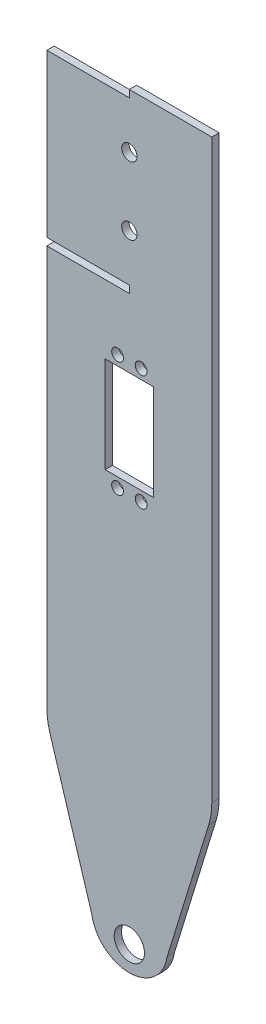
ISO-10303-21;
HEADER;
FILE_DESCRIPTION(('STEP AP214'),'2;1');
FILE_NAME('part.step','',(''),(''),'','','');
FILE_SCHEMA(('AUTOMOTIVE_DESIGN { 1 0 10303 214 1 1 1 1 }'));
ENDSEC;
DATA;
#1=APPLICATION_CONTEXT('core data for automotive mechanical design processes');
#2=APPLICATION_PROTOCOL_DEFINITION('international standard','automotive_design',2000,#1);
#3=PRODUCT_CONTEXT('',#1,'mechanical');
#4=PRODUCT('Part','Part','',(#3));
#5=PRODUCT_RELATED_PRODUCT_CATEGORY('part','',(#4));
#6=PRODUCT_DEFINITION_FORMATION('','',#4);
#7=PRODUCT_DEFINITION_CONTEXT('part definition',#1,'design');
#8=PRODUCT_DEFINITION('design','',#6,#7);
#9=PRODUCT_DEFINITION_SHAPE('','',#8);
#10=(LENGTH_UNIT() NAMED_UNIT(*) SI_UNIT(.MILLI.,.METRE.));
#11=(NAMED_UNIT(*) PLANE_ANGLE_UNIT() SI_UNIT($,.RADIAN.));
#12=(NAMED_UNIT(*) SI_UNIT($,.STERADIAN.) SOLID_ANGLE_UNIT());
#13=UNCERTAINTY_MEASURE_WITH_UNIT(LENGTH_MEASURE(1.E-05),#10,'distance_accuracy_value','');
#14=(GEOMETRIC_REPRESENTATION_CONTEXT(3) GLOBAL_UNCERTAINTY_ASSIGNED_CONTEXT((#13)) GLOBAL_UNIT_ASSIGNED_CONTEXT((#10,
#11,#12)) REPRESENTATION_CONTEXT('',''));
#15=CARTESIAN_POINT('',(0.,0.,0.));
#16=DIRECTION('',(0.,0.,1.));
#17=DIRECTION('',(1.,0.,0.));
#18=AXIS2_PLACEMENT_3D('',#15,#16,#17);
#19=CARTESIAN_POINT('',(-35.,-174.575,3.1));
#20=DIRECTION('',(1.,0.,0.));
#21=DIRECTION('',(0.,1.,0.));
#22=AXIS2_PLACEMENT_3D('',#19,#20,#21);
#23=PLANE('',#22);
#24=DIRECTION('',(0.,-1.,0.));
#25=VECTOR('',#24,1.);
#26=CARTESIAN_POINT('',(-35.,-174.575,3.1));
#27=LINE('',#26,#25);
#28=CARTESIAN_POINT('',(-35.,99.5750000000002,3.1));
#29=VERTEX_POINT('',#28);
#30=CARTESIAN_POINT('',(-35.,-70.0601124496381,3.1));
#31=VERTEX_POINT('',#30);
#32=EDGE_CURVE('E297',#29,#31,#27,.T.);
#33=ORIENTED_EDGE('',*,*,#32,.F.);
#34=DIRECTION('',(0.,0.,1.));
#35=VECTOR('',#34,1.);
#36=CARTESIAN_POINT('',(-35.,99.5750000000002,0.));
#37=LINE('',#36,#35);
#38=CARTESIAN_POINT('',(-35.,99.5750000000002,0.));
#39=VERTEX_POINT('',#38);
#40=EDGE_CURVE('E192',#39,#29,#37,.T.);
#41=ORIENTED_EDGE('',*,*,#40,.F.);
#42=DIRECTION('',(0.,-1.,0.));
#43=VECTOR('',#42,1.);
#44=CARTESIAN_POINT('',(-35.,-174.575,0.));
#45=LINE('',#44,#43);
#46=CARTESIAN_POINT('',(-35.,-70.0601124496381,0.));
#47=VERTEX_POINT('',#46);
#48=EDGE_CURVE('E306',#39,#47,#45,.T.);
#49=ORIENTED_EDGE('',*,*,#48,.T.);
#50=DIRECTION('',(0.,0.,-1.));
#51=VECTOR('',#50,1.);
#52=CARTESIAN_POINT('',(-35.,-70.0601124496381,3.1000000000001));
#53=LINE('',#52,#51);
#54=EDGE_CURVE('E320',#47,#31,#53,.F.);
#55=ORIENTED_EDGE('',*,*,#54,.T.);
#56=EDGE_LOOP('',(#33,#41,#49,#55));
#57=FACE_BOUND('',#56,.T.);
#58=ADVANCED_FACE('F32',(#57),#23,.F.);
#59=CARTESIAN_POINT('',(0.,0.,3.1));
#60=DIRECTION('',(0.,0.,-1.));
#61=DIRECTION('',(-1.,0.,0.));
#62=AXIS2_PLACEMENT_3D('',#59,#60,#61);
#63=PLANE('',#62);
#64=CARTESIAN_POINT('',(0.,151.475,3.1));
#65=DIRECTION('',(0.,0.,1.));
#66=DIRECTION('',(1.,0.,0.));
#67=AXIS2_PLACEMENT_3D('',#64,#65,#66);
#68=CIRCLE('',#67,3.25);
#69=CARTESIAN_POINT('',(3.25,151.475,3.1));
#70=VERTEX_POINT('',#69);
#71=EDGE_CURVE('E469',#70,#70,#68,.T.);
#72=ORIENTED_EDGE('',*,*,#71,.F.);
#73=EDGE_LOOP('',(#72));
#74=FACE_BOUND('',#73,.T.);
#75=CARTESIAN_POINT('',(0.,122.675,3.1));
#76=DIRECTION('',(0.,0.,1.));
#77=DIRECTION('',(1.,0.,0.));
#78=AXIS2_PLACEMENT_3D('',#75,#76,#77);
#79=CIRCLE('',#78,3.25);
#80=CARTESIAN_POINT('',(3.25,122.675,3.1));
#81=VERTEX_POINT('',#80);
#82=EDGE_CURVE('E182',#81,#81,#79,.T.);
#83=ORIENTED_EDGE('',*,*,#82,.F.);
#84=EDGE_LOOP('',(#83));
#85=FACE_BOUND('',#84,.T.);
#86=CARTESIAN_POINT('',(-5.00000000000007,25.5750000000002,3.1));
#87=DIRECTION('',(0.,0.,1.));
#88=DIRECTION('',(-1.,0.,0.));
#89=AXIS2_PLACEMENT_3D('',#86,#87,#88);
#90=CIRCLE('',#89,2.5);
#91=CARTESIAN_POINT('',(-7.50000000000007,25.5750000000002,3.1));
#92=VERTEX_POINT('',#91);
#93=EDGE_CURVE('E230',#92,#92,#90,.T.);
#94=ORIENTED_EDGE('',*,*,#93,.F.);
#95=EDGE_LOOP('',(#94));
#96=FACE_BOUND('',#95,.T.);
#97=CARTESIAN_POINT('',(4.99999999999993,74.5750000000002,3.1));
#98=DIRECTION('',(0.,0.,1.));
#99=DIRECTION('',(-1.,0.,0.));
#100=AXIS2_PLACEMENT_3D('',#97,#98,#99);
#101=CIRCLE('',#100,2.5);
#102=CARTESIAN_POINT('',(2.49999999999993,74.5750000000002,3.1));
#103=VERTEX_POINT('',#102);
#104=EDGE_CURVE('E242',#103,#103,#101,.T.);
#105=ORIENTED_EDGE('',*,*,#104,.F.);
#106=EDGE_LOOP('',(#105));
#107=FACE_BOUND('',#106,.T.);
#108=DIRECTION('',(0.,1.,0.));
#109=VECTOR('',#108,1.);
#110=CARTESIAN_POINT('',(10.25,29.7250000000002,3.1));
#111=LINE('',#110,#109);
#112=CARTESIAN_POINT('',(10.25,29.7250000000002,3.1));
#113=VERTEX_POINT('',#112);
#114=CARTESIAN_POINT('',(10.25,70.4250000000002,3.1));
#115=VERTEX_POINT('',#114);
#116=EDGE_CURVE('E254',#113,#115,#111,.T.);
#117=ORIENTED_EDGE('',*,*,#116,.F.);
#118=DIRECTION('',(1.,0.,0.));
#119=VECTOR('',#118,1.);
#120=CARTESIAN_POINT('',(-10.25,29.7250000000002,3.1));
#121=LINE('',#120,#119);
#122=CARTESIAN_POINT('',(-10.25,29.7250000000002,3.1));
#123=VERTEX_POINT('',#122);
#124=EDGE_CURVE('E262',#123,#113,#121,.T.);
#125=ORIENTED_EDGE('',*,*,#124,.F.);
#126=DIRECTION('',(0.,-1.,0.));
#127=VECTOR('',#126,1.);
#128=CARTESIAN_POINT('',(-10.25,29.7250000000002,3.1));
#129=LINE('',#128,#127);
#130=CARTESIAN_POINT('',(-10.25,70.4250000000002,3.1));
#131=VERTEX_POINT('',#130);
#132=EDGE_CURVE('E259',#131,#123,#129,.T.);
#133=ORIENTED_EDGE('',*,*,#132,.F.);
#134=DIRECTION('',(-1.,0.,0.));
#135=VECTOR('',#134,1.);
#136=CARTESIAN_POINT('',(-10.25,70.4250000000002,3.1));
#137=LINE('',#136,#135);
#138=EDGE_CURVE('E256',#115,#131,#137,.T.);
#139=ORIENTED_EDGE('',*,*,#138,.F.);
#140=EDGE_LOOP('',(#117,#125,#133,#139));
#141=FACE_BOUND('',#140,.T.);
#142=CARTESIAN_POINT('',(0.,-139.575,3.1));
#143=DIRECTION('',(0.,0.,1.));
#144=DIRECTION('',(1.,0.,0.));
#145=AXIS2_PLACEMENT_3D('',#142,#143,#144);
#146=CIRCLE('',#145,6.425);
#147=CARTESIAN_POINT('',(6.42500000000003,-139.575,3.1));
#148=VERTEX_POINT('',#147);
#149=EDGE_CURVE('E285',#148,#148,#146,.T.);
#150=ORIENTED_EDGE('',*,*,#149,.F.);
#151=EDGE_LOOP('',(#150));
#152=FACE_BOUND('',#151,.T.);
#153=CARTESIAN_POINT('',(-5.00000000000007,74.5750000000002,3.1));
#154=DIRECTION('',(0.,0.,1.));
#155=DIRECTION('',(1.,0.,0.));
#156=AXIS2_PLACEMENT_3D('',#153,#154,#155);
#157=CIRCLE('',#156,2.5);
#158=CARTESIAN_POINT('',(-2.50000000000007,74.5750000000002,3.1));
#159=VERTEX_POINT('',#158);
#160=EDGE_CURVE('E248',#159,#159,#157,.T.);
#161=ORIENTED_EDGE('',*,*,#160,.F.);
#162=EDGE_LOOP('',(#161));
#163=FACE_BOUND('',#162,.T.);
#164=CARTESIAN_POINT('',(4.99999999999993,25.5750000000002,3.1));
#165=DIRECTION('',(0.,0.,1.));
#166=DIRECTION('',(1.,0.,0.));
#167=AXIS2_PLACEMENT_3D('',#164,#165,#166);
#168=CIRCLE('',#167,2.5);
#169=CARTESIAN_POINT('',(7.49999999999993,25.5750000000002,3.1));
#170=VERTEX_POINT('',#169);
#171=EDGE_CURVE('E236',#170,#170,#168,.T.);
#172=ORIENTED_EDGE('',*,*,#171,.F.);
#173=EDGE_LOOP('',(#172));
#174=FACE_BOUND('',#173,.T.);
#175=DIRECTION('',(0.,1.,0.));
#176=VECTOR('',#175,1.);
#177=CARTESIAN_POINT('',(0.,102.675,3.1));
#178=LINE('',#177,#176);
#179=CARTESIAN_POINT('',(0.,99.5750000000002,3.1));
#180=VERTEX_POINT('',#179);
#181=CARTESIAN_POINT('',(0.,102.675,3.1));
#182=VERTEX_POINT('',#181);
#183=EDGE_CURVE('E163',#180,#182,#178,.T.);
#184=ORIENTED_EDGE('',*,*,#183,.F.);
#185=DIRECTION('',(1.,0.,0.));
#186=VECTOR('',#185,1.);
#187=CARTESIAN_POINT('',(0.,99.5750000000002,3.1));
#188=LINE('',#187,#186);
#189=EDGE_CURVE('E177',#29,#180,#188,.T.);
#190=ORIENTED_EDGE('',*,*,#189,.F.);
#191=ORIENTED_EDGE('',*,*,#32,.T.);
#192=CARTESIAN_POINT('',(-5.,-70.0601124496381,3.09999999999999));
#193=DIRECTION('',(0.,0.,-1.));
#194=DIRECTION('',(-1.,0.,0.));
#195=AXIS2_PLACEMENT_3D('',#192,#193,#194);
#196=CIRCLE('',#195,30.);
#197=CARTESIAN_POINT('',(-33.6711499797607,-78.8899006032727,3.1));
#198=VERTEX_POINT('',#197);
#199=EDGE_CURVE('E325',#31,#198,#196,.F.);
#200=ORIENTED_EDGE('',*,*,#199,.T.);
#201=DIRECTION('',(-0.294326271787818,0.955704999325359,0.));
#202=VECTOR('',#201,1.);
#203=CARTESIAN_POINT('',(-52.9451554412861,-16.3053978175907,3.1));
#204=LINE('',#203,#202);
#205=CARTESIAN_POINT('',(-16.,-136.269781362475,3.09999999999999));
#206=VERTEX_POINT('',#205);
#207=EDGE_CURVE('E219',#206,#198,#204,.T.);
#208=ORIENTED_EDGE('',*,*,#207,.F.);
#209=CARTESIAN_POINT('',(0.,-133.872837699514,3.09999999999999));
#210=DIRECTION('',(0.,0.,-1.));
#211=DIRECTION('',(-1.,0.,0.));
#212=AXIS2_PLACEMENT_3D('',#209,#210,#211);
#213=CIRCLE('',#212,16.1785456368429);
#214=CARTESIAN_POINT('',(16.,-136.269781362475,3.1));
#215=VERTEX_POINT('',#214);
#216=EDGE_CURVE('E226',#215,#206,#213,.T.);
#217=ORIENTED_EDGE('',*,*,#216,.F.);
#218=DIRECTION('',(-0.294326271787818,-0.955704999325358,0.));
#219=VECTOR('',#218,1.);
#220=CARTESIAN_POINT('',(52.9451554412861,-16.3053978175907,3.1));
#221=LINE('',#220,#219);
#222=CARTESIAN_POINT('',(33.6711499797608,-78.8899006032725,3.1));
#223=VERTEX_POINT('',#222);
#224=EDGE_CURVE('E224',#223,#215,#221,.T.);
#225=ORIENTED_EDGE('',*,*,#224,.F.);
#226=CARTESIAN_POINT('',(5.00000000000005,-70.060112449638,3.09999999999999));
#227=DIRECTION('',(0.,0.,-1.));
#228=DIRECTION('',(-1.,0.,0.));
#229=AXIS2_PLACEMENT_3D('',#226,#227,#228);
#230=CIRCLE('',#229,30.);
#231=CARTESIAN_POINT('',(35.,-70.060112449638,3.1));
#232=VERTEX_POINT('',#231);
#233=EDGE_CURVE('E323',#223,#232,#230,.F.);
#234=ORIENTED_EDGE('',*,*,#233,.T.);
#235=DIRECTION('',(0.,1.,0.));
#236=VECTOR('',#235,1.);
#237=CARTESIAN_POINT('',(35.,-174.575,3.1));
#238=LINE('',#237,#236);
#239=CARTESIAN_POINT('',(35.,174.575,3.1));
#240=VERTEX_POINT('',#239);
#241=EDGE_CURVE('E291',#232,#240,#238,.T.);
#242=ORIENTED_EDGE('',*,*,#241,.T.);
#243=DIRECTION('',(-1.,0.,0.));
#244=VECTOR('',#243,1.);
#245=CARTESIAN_POINT('',(-35.,174.575,3.1));
#246=LINE('',#245,#244);
#247=CARTESIAN_POINT('',(0.,174.575,3.1));
#248=VERTEX_POINT('',#247);
#249=EDGE_CURVE('E293',#240,#248,#246,.T.);
#250=ORIENTED_EDGE('',*,*,#249,.T.);
#251=DIRECTION('',(0.,1.,0.));
#252=VECTOR('',#251,1.);
#253=CARTESIAN_POINT('',(0.,174.575,3.1));
#254=LINE('',#253,#252);
#255=CARTESIAN_POINT('',(0.,171.475,3.1));
#256=VERTEX_POINT('',#255);
#257=EDGE_CURVE('E55',#256,#248,#254,.T.);
#258=ORIENTED_EDGE('',*,*,#257,.F.);
#259=DIRECTION('',(1.,0.,0.));
#260=VECTOR('',#259,1.);
#261=CARTESIAN_POINT('',(-35.,171.475,3.1));
#262=LINE('',#261,#260);
#263=CARTESIAN_POINT('',(-35.,171.475,3.1));
#264=VERTEX_POINT('',#263);
#265=EDGE_CURVE('E191',#264,#256,#262,.T.);
#266=ORIENTED_EDGE('',*,*,#265,.F.);
#267=CARTESIAN_POINT('',(-35.,102.675,3.1));
#268=VERTEX_POINT('',#267);
#269=EDGE_CURVE('E298',#264,#268,#27,.T.);
#270=ORIENTED_EDGE('',*,*,#269,.T.);
#271=DIRECTION('',(-1.,0.,0.));
#272=VECTOR('',#271,1.);
#273=CARTESIAN_POINT('',(0.,102.675,3.1));
#274=LINE('',#273,#272);
#275=EDGE_CURVE('E47',#182,#268,#274,.T.);
#276=ORIENTED_EDGE('',*,*,#275,.F.);
#277=EDGE_LOOP('',(#184,#190,#191,#200,#208,#217,#225,#234,#242,#250,#258,#266,#270,#276));
#278=FACE_BOUND('',#277,.T.);
#279=ADVANCED_FACE('F336',(#74,#85,#96,#107,#141,#152,#163,#174,#278),#63,.F.);
#280=CARTESIAN_POINT('',(0.,0.,0.));
#281=DIRECTION('',(0.,0.,-1.));
#282=DIRECTION('',(-1.,0.,0.));
#283=AXIS2_PLACEMENT_3D('',#280,#281,#282);
#284=PLANE('',#283);
#285=CARTESIAN_POINT('',(0.,151.475,0.));
#286=DIRECTION('',(0.,0.,1.));
#287=DIRECTION('',(1.,0.,0.));
#288=AXIS2_PLACEMENT_3D('',#285,#286,#287);
#289=CIRCLE('',#288,3.25);
#290=CARTESIAN_POINT('',(3.25,151.475,0.));
#291=VERTEX_POINT('',#290);
#292=EDGE_CURVE('E466',#291,#291,#289,.T.);
#293=ORIENTED_EDGE('',*,*,#292,.T.);
#294=EDGE_LOOP('',(#293));
#295=FACE_BOUND('',#294,.T.);
#296=CARTESIAN_POINT('',(0.,122.675,0.));
#297=DIRECTION('',(0.,0.,1.));
#298=DIRECTION('',(1.,0.,0.));
#299=AXIS2_PLACEMENT_3D('',#296,#297,#298);
#300=CIRCLE('',#299,3.25);
#301=CARTESIAN_POINT('',(3.25,122.675,0.));
#302=VERTEX_POINT('',#301);
#303=EDGE_CURVE('E187',#302,#302,#300,.T.);
#304=ORIENTED_EDGE('',*,*,#303,.T.);
#305=EDGE_LOOP('',(#304));
#306=FACE_BOUND('',#305,.T.);
#307=DIRECTION('',(1.,0.,0.));
#308=VECTOR('',#307,1.);
#309=CARTESIAN_POINT('',(0.,99.5750000000002,0.));
#310=LINE('',#309,#308);
#311=CARTESIAN_POINT('',(0.,99.5750000000002,0.));
#312=VERTEX_POINT('',#311);
#313=EDGE_CURVE('E165',#39,#312,#310,.T.);
#314=ORIENTED_EDGE('',*,*,#313,.T.);
#315=DIRECTION('',(0.,1.,0.));
#316=VECTOR('',#315,1.);
#317=CARTESIAN_POINT('',(0.,102.675,0.));
#318=LINE('',#317,#316);
#319=CARTESIAN_POINT('',(0.,102.675,0.));
#320=VERTEX_POINT('',#319);
#321=EDGE_CURVE('E160',#312,#320,#318,.T.);
#322=ORIENTED_EDGE('',*,*,#321,.T.);
#323=DIRECTION('',(-1.,0.,0.));
#324=VECTOR('',#323,1.);
#325=CARTESIAN_POINT('',(0.,102.675,0.));
#326=LINE('',#325,#324);
#327=CARTESIAN_POINT('',(-35.,102.675,0.));
#328=VERTEX_POINT('',#327);
#329=EDGE_CURVE('E168',#320,#328,#326,.T.);
#330=ORIENTED_EDGE('',*,*,#329,.T.);
#331=CARTESIAN_POINT('',(-35.,171.475,0.));
#332=VERTEX_POINT('',#331);
#333=EDGE_CURVE('E294',#332,#328,#45,.T.);
#334=ORIENTED_EDGE('',*,*,#333,.F.);
#335=DIRECTION('',(1.,0.,0.));
#336=VECTOR('',#335,1.);
#337=CARTESIAN_POINT('',(-35.,171.475,0.));
#338=LINE('',#337,#336);
#339=CARTESIAN_POINT('',(0.,171.475,0.));
#340=VERTEX_POINT('',#339);
#341=EDGE_CURVE('E195',#332,#340,#338,.T.);
#342=ORIENTED_EDGE('',*,*,#341,.T.);
#343=DIRECTION('',(0.,1.,0.));
#344=VECTOR('',#343,1.);
#345=CARTESIAN_POINT('',(0.,174.575,0.));
#346=LINE('',#345,#344);
#347=CARTESIAN_POINT('',(0.,174.575,0.));
#348=VERTEX_POINT('',#347);
#349=EDGE_CURVE('E198',#340,#348,#346,.T.);
#350=ORIENTED_EDGE('',*,*,#349,.T.);
#351=DIRECTION('',(-1.,0.,0.));
#352=VECTOR('',#351,1.);
#353=CARTESIAN_POINT('',(-35.,174.575,0.));
#354=LINE('',#353,#352);
#355=CARTESIAN_POINT('',(35.,174.575,0.));
#356=VERTEX_POINT('',#355);
#357=EDGE_CURVE('E303',#356,#348,#354,.T.);
#358=ORIENTED_EDGE('',*,*,#357,.F.);
#359=DIRECTION('',(0.,1.,0.));
#360=VECTOR('',#359,1.);
#361=CARTESIAN_POINT('',(35.,-174.575,0.));
#362=LINE('',#361,#360);
#363=CARTESIAN_POINT('',(35.,-70.060112449638,0.));
#364=VERTEX_POINT('',#363);
#365=EDGE_CURVE('E288',#364,#356,#362,.T.);
#366=ORIENTED_EDGE('',*,*,#365,.F.);
#367=CARTESIAN_POINT('',(5.00000000000005,-70.060112449638,0.));
#368=DIRECTION('',(0.,0.,-1.));
#369=DIRECTION('',(-1.,0.,0.));
#370=AXIS2_PLACEMENT_3D('',#367,#368,#369);
#371=CIRCLE('',#370,30.);
#372=CARTESIAN_POINT('',(33.6711499797608,-78.8899006032725,0.));
#373=VERTEX_POINT('',#372);
#374=EDGE_CURVE('E315',#364,#373,#371,.T.);
#375=ORIENTED_EDGE('',*,*,#374,.T.);
#376=DIRECTION('',(-0.294326271787818,-0.955704999325358,0.));
#377=VECTOR('',#376,1.);
#378=CARTESIAN_POINT('',(52.9451554412861,-16.3053978175907,0.));
#379=LINE('',#378,#377);
#380=CARTESIAN_POINT('',(16.,-136.269781362475,0.));
#381=VERTEX_POINT('',#380);
#382=EDGE_CURVE('E222',#373,#381,#379,.T.);
#383=ORIENTED_EDGE('',*,*,#382,.T.);
#384=CARTESIAN_POINT('',(0.,-133.872837699514,0.));
#385=DIRECTION('',(0.,0.,-1.));
#386=DIRECTION('',(-1.,0.,0.));
#387=AXIS2_PLACEMENT_3D('',#384,#385,#386);
#388=CIRCLE('',#387,16.1785456368429);
#389=CARTESIAN_POINT('',(-16.,-136.269781362475,0.));
#390=VERTEX_POINT('',#389);
#391=EDGE_CURVE('E310',#381,#390,#388,.T.);
#392=ORIENTED_EDGE('',*,*,#391,.T.);
#393=DIRECTION('',(-0.294326271787818,0.955704999325359,0.));
#394=VECTOR('',#393,1.);
#395=CARTESIAN_POINT('',(-52.9451554412861,-16.3053978175907,0.));
#396=LINE('',#395,#394);
#397=CARTESIAN_POINT('',(-33.6711499797607,-78.8899006032727,0.));
#398=VERTEX_POINT('',#397);
#399=EDGE_CURVE('E216',#390,#398,#396,.T.);
#400=ORIENTED_EDGE('',*,*,#399,.T.);
#401=CARTESIAN_POINT('',(-5.,-70.0601124496381,0.));
#402=DIRECTION('',(0.,0.,-1.));
#403=DIRECTION('',(-1.,0.,0.));
#404=AXIS2_PLACEMENT_3D('',#401,#402,#403);
#405=CIRCLE('',#404,30.);
#406=EDGE_CURVE('E317',#398,#47,#405,.T.);
#407=ORIENTED_EDGE('',*,*,#406,.T.);
#408=ORIENTED_EDGE('',*,*,#48,.F.);
#409=EDGE_LOOP('',(#314,#322,#330,#334,#342,#350,#358,#366,#375,#383,#392,#400,#407,#408));
#410=FACE_BOUND('',#409,.T.);
#411=CARTESIAN_POINT('',(-5.00000000000007,25.5750000000002,0.));
#412=DIRECTION('',(0.,0.,1.));
#413=DIRECTION('',(-1.,0.,0.));
#414=AXIS2_PLACEMENT_3D('',#411,#412,#413);
#415=CIRCLE('',#414,2.5);
#416=CARTESIAN_POINT('',(-7.50000000000007,25.5750000000002,0.));
#417=VERTEX_POINT('',#416);
#418=EDGE_CURVE('E229',#417,#417,#415,.T.);
#419=ORIENTED_EDGE('',*,*,#418,.T.);
#420=EDGE_LOOP('',(#419));
#421=FACE_BOUND('',#420,.T.);
#422=CARTESIAN_POINT('',(4.99999999999993,74.5750000000002,0.));
#423=DIRECTION('',(0.,0.,1.));
#424=DIRECTION('',(-1.,0.,0.));
#425=AXIS2_PLACEMENT_3D('',#422,#423,#424);
#426=CIRCLE('',#425,2.5);
#427=CARTESIAN_POINT('',(2.49999999999993,74.5750000000002,0.));
#428=VERTEX_POINT('',#427);
#429=EDGE_CURVE('E239',#428,#428,#426,.T.);
#430=ORIENTED_EDGE('',*,*,#429,.T.);
#431=EDGE_LOOP('',(#430));
#432=FACE_BOUND('',#431,.T.);
#433=DIRECTION('',(1.,0.,0.));
#434=VECTOR('',#433,1.);
#435=CARTESIAN_POINT('',(-10.25,29.7250000000002,0.));
#436=LINE('',#435,#434);
#437=CARTESIAN_POINT('',(-10.25,29.7250000000002,0.));
#438=VERTEX_POINT('',#437);
#439=CARTESIAN_POINT('',(10.25,29.7250000000002,0.));
#440=VERTEX_POINT('',#439);
#441=EDGE_CURVE('E257',#438,#440,#436,.T.);
#442=ORIENTED_EDGE('',*,*,#441,.T.);
#443=DIRECTION('',(0.,1.,0.));
#444=VECTOR('',#443,1.);
#445=CARTESIAN_POINT('',(10.25,29.7250000000002,0.));
#446=LINE('',#445,#444);
#447=CARTESIAN_POINT('',(10.25,70.4250000000002,0.));
#448=VERTEX_POINT('',#447);
#449=EDGE_CURVE('E251',#440,#448,#446,.T.);
#450=ORIENTED_EDGE('',*,*,#449,.T.);
#451=DIRECTION('',(-1.,0.,0.));
#452=VECTOR('',#451,1.);
#453=CARTESIAN_POINT('',(-10.25,70.4250000000002,0.));
#454=LINE('',#453,#452);
#455=CARTESIAN_POINT('',(-10.25,70.4250000000002,0.));
#456=VERTEX_POINT('',#455);
#457=EDGE_CURVE('E267',#448,#456,#454,.T.);
#458=ORIENTED_EDGE('',*,*,#457,.T.);
#459=DIRECTION('',(0.,-1.,0.));
#460=VECTOR('',#459,1.);
#461=CARTESIAN_POINT('',(-10.25,29.7250000000002,0.));
#462=LINE('',#461,#460);
#463=EDGE_CURVE('E270',#456,#438,#462,.T.);
#464=ORIENTED_EDGE('',*,*,#463,.T.);
#465=EDGE_LOOP('',(#442,#450,#458,#464));
#466=FACE_BOUND('',#465,.T.);
#467=CARTESIAN_POINT('',(0.,-139.575,0.));
#468=DIRECTION('',(0.,0.,1.));
#469=DIRECTION('',(1.,0.,0.));
#470=AXIS2_PLACEMENT_3D('',#467,#468,#469);
#471=CIRCLE('',#470,6.425);
#472=CARTESIAN_POINT('',(6.42500000000003,-139.575,0.));
#473=VERTEX_POINT('',#472);
#474=EDGE_CURVE('E284',#473,#473,#471,.T.);
#475=ORIENTED_EDGE('',*,*,#474,.T.);
#476=EDGE_LOOP('',(#475));
#477=FACE_BOUND('',#476,.T.);
#478=CARTESIAN_POINT('',(-5.00000000000007,74.5750000000002,0.));
#479=DIRECTION('',(0.,0.,1.));
#480=DIRECTION('',(1.,0.,0.));
#481=AXIS2_PLACEMENT_3D('',#478,#479,#480);
#482=CIRCLE('',#481,2.5);
#483=CARTESIAN_POINT('',(-2.50000000000007,74.5750000000002,0.));
#484=VERTEX_POINT('',#483);
#485=EDGE_CURVE('E245',#484,#484,#482,.T.);
#486=ORIENTED_EDGE('',*,*,#485,.T.);
#487=EDGE_LOOP('',(#486));
#488=FACE_BOUND('',#487,.T.);
#489=CARTESIAN_POINT('',(4.99999999999993,25.5750000000002,0.));
#490=DIRECTION('',(0.,0.,1.));
#491=DIRECTION('',(1.,0.,0.));
#492=AXIS2_PLACEMENT_3D('',#489,#490,#491);
#493=CIRCLE('',#492,2.5);
#494=CARTESIAN_POINT('',(7.49999999999993,25.5750000000002,0.));
#495=VERTEX_POINT('',#494);
#496=EDGE_CURVE('E233',#495,#495,#493,.T.);
#497=ORIENTED_EDGE('',*,*,#496,.T.);
#498=EDGE_LOOP('',(#497));
#499=FACE_BOUND('',#498,.T.);
#500=ADVANCED_FACE('F174',(#295,#306,#410,#421,#432,#466,#477,#488,#499),#284,.T.);
#501=CARTESIAN_POINT('',(35.,-174.575,3.1));
#502=DIRECTION('',(-1.,0.,0.));
#503=DIRECTION('',(0.,-1.,0.));
#504=AXIS2_PLACEMENT_3D('',#501,#502,#503);
#505=PLANE('',#504);
#506=ORIENTED_EDGE('',*,*,#241,.F.);
#507=DIRECTION('',(0.,0.,1.));
#508=VECTOR('',#507,1.);
#509=CARTESIAN_POINT('',(35.,-70.060112449638,0.));
#510=LINE('',#509,#508);
#511=EDGE_CURVE('E11',#232,#364,#510,.F.);
#512=ORIENTED_EDGE('',*,*,#511,.T.);
#513=ORIENTED_EDGE('',*,*,#365,.T.);
#514=DIRECTION('',(0.,0.,-1.));
#515=VECTOR('',#514,1.);
#516=CARTESIAN_POINT('',(35.,174.575,3.1));
#517=LINE('',#516,#515);
#518=EDGE_CURVE('E301',#240,#356,#517,.T.);
#519=ORIENTED_EDGE('',*,*,#518,.F.);
#520=EDGE_LOOP('',(#506,#512,#513,#519));
#521=FACE_BOUND('',#520,.T.);
#522=ADVANCED_FACE('F373',(#521),#505,.F.);
#523=ORIENTED_EDGE('',*,*,#333,.T.);
#524=DIRECTION('',(0.,0.,1.));
#525=VECTOR('',#524,1.);
#526=CARTESIAN_POINT('',(-35.,102.675,0.));
#527=LINE('',#526,#525);
#528=EDGE_CURVE('E164',#328,#268,#527,.T.);
#529=ORIENTED_EDGE('',*,*,#528,.T.);
#530=ORIENTED_EDGE('',*,*,#269,.F.);
#531=DIRECTION('',(0.,0.,1.));
#532=VECTOR('',#531,1.);
#533=CARTESIAN_POINT('',(-35.,171.475,0.));
#534=LINE('',#533,#532);
#535=EDGE_CURVE('E201',#332,#264,#534,.T.);
#536=ORIENTED_EDGE('',*,*,#535,.F.);
#537=EDGE_LOOP('',(#523,#529,#530,#536));
#538=FACE_BOUND('',#537,.T.);
#539=ADVANCED_FACE('F361',(#538),#23,.F.);
#540=CARTESIAN_POINT('',(-35.,174.575,3.1));
#541=DIRECTION('',(0.,-1.,0.));
#542=DIRECTION('',(0.,0.,-1.));
#543=AXIS2_PLACEMENT_3D('',#540,#541,#542);
#544=PLANE('',#543);
#545=ORIENTED_EDGE('',*,*,#357,.T.);
#546=DIRECTION('',(0.,0.,1.));
#547=VECTOR('',#546,1.);
#548=CARTESIAN_POINT('',(0.,174.575,0.));
#549=LINE('',#548,#547);
#550=EDGE_CURVE('E205',#348,#248,#549,.T.);
#551=ORIENTED_EDGE('',*,*,#550,.T.);
#552=ORIENTED_EDGE('',*,*,#249,.F.);
#553=ORIENTED_EDGE('',*,*,#518,.T.);
#554=EDGE_LOOP('',(#545,#551,#552,#553));
#555=FACE_BOUND('',#554,.T.);
#556=ADVANCED_FACE('F369',(#555),#544,.F.);
#557=CARTESIAN_POINT('',(0.,-139.575,3.1));
#558=DIRECTION('',(0.,0.,-1.));
#559=DIRECTION('',(-1.,0.,0.));
#560=AXIS2_PLACEMENT_3D('',#557,#558,#559);
#561=CYLINDRICAL_SURFACE('',#560,6.425);
#562=ORIENTED_EDGE('',*,*,#149,.T.);
#563=EDGE_LOOP('',(#562));
#564=FACE_BOUND('',#563,.T.);
#565=ORIENTED_EDGE('',*,*,#474,.F.);
#566=EDGE_LOOP('',(#565));
#567=FACE_BOUND('',#566,.T.);
#568=ADVANCED_FACE('F395',(#564,#567),#561,.F.);
#569=CARTESIAN_POINT('',(10.25,29.7250000000002,3.1));
#570=DIRECTION('',(-1.,0.,0.));
#571=DIRECTION('',(0.,0.,1.));
#572=AXIS2_PLACEMENT_3D('',#569,#570,#571);
#573=PLANE('',#572);
#574=ORIENTED_EDGE('',*,*,#449,.F.);
#575=DIRECTION('',(0.,0.,-1.));
#576=VECTOR('',#575,1.);
#577=CARTESIAN_POINT('',(10.25,29.7250000000002,3.1));
#578=LINE('',#577,#576);
#579=EDGE_CURVE('E264',#113,#440,#578,.T.);
#580=ORIENTED_EDGE('',*,*,#579,.F.);
#581=ORIENTED_EDGE('',*,*,#116,.T.);
#582=DIRECTION('',(0.,0.,-1.));
#583=VECTOR('',#582,1.);
#584=CARTESIAN_POINT('',(10.25,70.4250000000002,3.1));
#585=LINE('',#584,#583);
#586=EDGE_CURVE('E281',#115,#448,#585,.T.);
#587=ORIENTED_EDGE('',*,*,#586,.T.);
#588=EDGE_LOOP('',(#574,#580,#581,#587));
#589=FACE_BOUND('',#588,.T.);
#590=ADVANCED_FACE('F408',(#589),#573,.T.);
#591=CARTESIAN_POINT('',(-10.25,70.4250000000002,3.1));
#592=DIRECTION('',(0.,-1.,0.));
#593=DIRECTION('',(0.,0.,-1.));
#594=AXIS2_PLACEMENT_3D('',#591,#592,#593);
#595=PLANE('',#594);
#596=ORIENTED_EDGE('',*,*,#457,.F.);
#597=ORIENTED_EDGE('',*,*,#586,.F.);
#598=ORIENTED_EDGE('',*,*,#138,.T.);
#599=DIRECTION('',(0.,0.,-1.));
#600=VECTOR('',#599,1.);
#601=CARTESIAN_POINT('',(-10.25,70.4250000000002,3.1));
#602=LINE('',#601,#600);
#603=EDGE_CURVE('E279',#131,#456,#602,.T.);
#604=ORIENTED_EDGE('',*,*,#603,.T.);
#605=EDGE_LOOP('',(#596,#597,#598,#604));
#606=FACE_BOUND('',#605,.T.);
#607=ADVANCED_FACE('F412',(#606),#595,.T.);
#608=CARTESIAN_POINT('',(-10.25,29.7250000000002,3.1));
#609=DIRECTION('',(1.,0.,0.));
#610=DIRECTION('',(0.,0.,-1.));
#611=AXIS2_PLACEMENT_3D('',#608,#609,#610);
#612=PLANE('',#611);
#613=ORIENTED_EDGE('',*,*,#463,.F.);
#614=ORIENTED_EDGE('',*,*,#603,.F.);
#615=ORIENTED_EDGE('',*,*,#132,.T.);
#616=DIRECTION('',(0.,0.,-1.));
#617=VECTOR('',#616,1.);
#618=CARTESIAN_POINT('',(-10.25,29.7250000000002,3.1));
#619=LINE('',#618,#617);
#620=EDGE_CURVE('E277',#123,#438,#619,.T.);
#621=ORIENTED_EDGE('',*,*,#620,.T.);
#622=EDGE_LOOP('',(#613,#614,#615,#621));
#623=FACE_BOUND('',#622,.T.);
#624=ADVANCED_FACE('F416',(#623),#612,.T.);
#625=CARTESIAN_POINT('',(-10.25,29.7250000000002,3.1));
#626=DIRECTION('',(0.,1.,0.));
#627=DIRECTION('',(-1.,0.,0.));
#628=AXIS2_PLACEMENT_3D('',#625,#626,#627);
#629=PLANE('',#628);
#630=ORIENTED_EDGE('',*,*,#441,.F.);
#631=ORIENTED_EDGE('',*,*,#620,.F.);
#632=ORIENTED_EDGE('',*,*,#124,.T.);
#633=ORIENTED_EDGE('',*,*,#579,.T.);
#634=EDGE_LOOP('',(#630,#631,#632,#633));
#635=FACE_BOUND('',#634,.T.);
#636=ADVANCED_FACE('F420',(#635),#629,.T.);
#637=CARTESIAN_POINT('',(-5.00000000000007,74.5750000000002,3.1));
#638=DIRECTION('',(0.,0.,-1.));
#639=DIRECTION('',(-1.,0.,0.));
#640=AXIS2_PLACEMENT_3D('',#637,#638,#639);
#641=CYLINDRICAL_SURFACE('',#640,2.5);
#642=ORIENTED_EDGE('',*,*,#160,.T.);
#643=EDGE_LOOP('',(#642));
#644=FACE_BOUND('',#643,.T.);
#645=ORIENTED_EDGE('',*,*,#485,.F.);
#646=EDGE_LOOP('',(#645));
#647=FACE_BOUND('',#646,.T.);
#648=ADVANCED_FACE('F424',(#644,#647),#641,.F.);
#649=CARTESIAN_POINT('',(4.99999999999993,74.5750000000002,3.1));
#650=DIRECTION('',(0.,0.,-1.));
#651=DIRECTION('',(-1.,0.,0.));
#652=AXIS2_PLACEMENT_3D('',#649,#650,#651);
#653=CYLINDRICAL_SURFACE('',#652,2.5);
#654=ORIENTED_EDGE('',*,*,#104,.T.);
#655=EDGE_LOOP('',(#654));
#656=FACE_BOUND('',#655,.T.);
#657=ORIENTED_EDGE('',*,*,#429,.F.);
#658=EDGE_LOOP('',(#657));
#659=FACE_BOUND('',#658,.T.);
#660=ADVANCED_FACE('F428',(#656,#659),#653,.F.);
#661=CARTESIAN_POINT('',(4.99999999999993,25.5750000000002,3.1));
#662=DIRECTION('',(0.,0.,-1.));
#663=DIRECTION('',(-1.,0.,0.));
#664=AXIS2_PLACEMENT_3D('',#661,#662,#663);
#665=CYLINDRICAL_SURFACE('',#664,2.5);
#666=ORIENTED_EDGE('',*,*,#171,.T.);
#667=EDGE_LOOP('',(#666));
#668=FACE_BOUND('',#667,.T.);
#669=ORIENTED_EDGE('',*,*,#496,.F.);
#670=EDGE_LOOP('',(#669));
#671=FACE_BOUND('',#670,.T.);
#672=ADVANCED_FACE('F432',(#668,#671),#665,.F.);
#673=CARTESIAN_POINT('',(-5.00000000000007,25.5750000000002,3.1));
#674=DIRECTION('',(0.,0.,-1.));
#675=DIRECTION('',(-1.,0.,0.));
#676=AXIS2_PLACEMENT_3D('',#673,#674,#675);
#677=CYLINDRICAL_SURFACE('',#676,2.5);
#678=ORIENTED_EDGE('',*,*,#93,.T.);
#679=EDGE_LOOP('',(#678));
#680=FACE_BOUND('',#679,.T.);
#681=ORIENTED_EDGE('',*,*,#418,.F.);
#682=EDGE_LOOP('',(#681));
#683=FACE_BOUND('',#682,.T.);
#684=ADVANCED_FACE('F436',(#680,#683),#677,.F.);
#685=CARTESIAN_POINT('',(0.,-133.872837699514,448.239255774246));
#686=DIRECTION('',(0.,0.,-1.));
#687=DIRECTION('',(-1.,0.,0.));
#688=AXIS2_PLACEMENT_3D('',#685,#686,#687);
#689=CYLINDRICAL_SURFACE('',#688,16.1785456368429);
#690=DIRECTION('',(0.,0.,-1.));
#691=VECTOR('',#690,1.);
#692=CARTESIAN_POINT('',(16.,-136.269781362475,448.239255774246));
#693=LINE('',#692,#691);
#694=EDGE_CURVE('E207',#215,#381,#693,.T.);
#695=ORIENTED_EDGE('',*,*,#694,.F.);
#696=ORIENTED_EDGE('',*,*,#216,.T.);
#697=DIRECTION('',(0.,0.,-1.));
#698=VECTOR('',#697,1.);
#699=CARTESIAN_POINT('',(-16.,-136.269781362475,448.239255774246));
#700=LINE('',#699,#698);
#701=EDGE_CURVE('E213',#206,#390,#700,.T.);
#702=ORIENTED_EDGE('',*,*,#701,.T.);
#703=ORIENTED_EDGE('',*,*,#391,.F.);
#704=EDGE_LOOP('',(#695,#696,#702,#703));
#705=FACE_BOUND('',#704,.T.);
#706=ADVANCED_FACE('F342',(#705),#689,.T.);
#707=CARTESIAN_POINT('',(35.0000000000001,-74.5749999999998,448.239255774246));
#708=DIRECTION('',(0.955704999325358,-0.294326271787818,0.));
#709=DIRECTION('',(0.294326271787818,0.955704999325358,0.));
#710=AXIS2_PLACEMENT_3D('',#707,#708,#709);
#711=PLANE('',#710);
#712=ORIENTED_EDGE('',*,*,#382,.F.);
#713=DIRECTION('',(0.,0.,1.));
#714=VECTOR('',#713,1.);
#715=CARTESIAN_POINT('',(33.6711499797608,-78.8899006032725,3.09999999999999));
#716=LINE('',#715,#714);
#717=EDGE_CURVE('E40',#373,#223,#716,.T.);
#718=ORIENTED_EDGE('',*,*,#717,.T.);
#719=ORIENTED_EDGE('',*,*,#224,.T.);
#720=ORIENTED_EDGE('',*,*,#694,.T.);
#721=EDGE_LOOP('',(#712,#718,#719,#720));
#722=FACE_BOUND('',#721,.T.);
#723=ADVANCED_FACE('F331',(#722),#711,.T.);
#724=CARTESIAN_POINT('',(-35.,-74.5749999999998,448.239255774246));
#725=DIRECTION('',(-0.955704999325358,-0.294326271787818,0.));
#726=DIRECTION('',(0.294326271787818,-0.955704999325359,0.));
#727=AXIS2_PLACEMENT_3D('',#724,#725,#726);
#728=PLANE('',#727);
#729=ORIENTED_EDGE('',*,*,#207,.T.);
#730=DIRECTION('',(0.,0.,-1.));
#731=VECTOR('',#730,1.);
#732=CARTESIAN_POINT('',(-33.6711499797607,-78.8899006032727,1.11022302462516E-13));
#733=LINE('',#732,#731);
#734=EDGE_CURVE('E312',#198,#398,#733,.T.);
#735=ORIENTED_EDGE('',*,*,#734,.T.);
#736=ORIENTED_EDGE('',*,*,#399,.F.);
#737=ORIENTED_EDGE('',*,*,#701,.F.);
#738=EDGE_LOOP('',(#729,#735,#736,#737));
#739=FACE_BOUND('',#738,.T.);
#740=ADVANCED_FACE('F345',(#739),#728,.T.);
#741=CARTESIAN_POINT('',(-5.,-70.0601124496381,448.239255774246));
#742=DIRECTION('',(0.,0.,1.));
#743=DIRECTION('',(1.,0.,0.));
#744=AXIS2_PLACEMENT_3D('',#741,#742,#743);
#745=CYLINDRICAL_SURFACE('',#744,30.);
#746=ORIENTED_EDGE('',*,*,#199,.F.);
#747=ORIENTED_EDGE('',*,*,#54,.F.);
#748=ORIENTED_EDGE('',*,*,#406,.F.);
#749=ORIENTED_EDGE('',*,*,#734,.F.);
#750=EDGE_LOOP('',(#746,#747,#748,#749));
#751=FACE_BOUND('',#750,.T.);
#752=ADVANCED_FACE('F349',(#751),#745,.T.);
#753=CARTESIAN_POINT('',(5.00000000000005,-70.060112449638,448.239255774246));
#754=DIRECTION('',(0.,0.,-1.));
#755=DIRECTION('',(-1.,0.,0.));
#756=AXIS2_PLACEMENT_3D('',#753,#754,#755);
#757=CYLINDRICAL_SURFACE('',#756,30.);
#758=ORIENTED_EDGE('',*,*,#374,.F.);
#759=ORIENTED_EDGE('',*,*,#511,.F.);
#760=ORIENTED_EDGE('',*,*,#233,.F.);
#761=ORIENTED_EDGE('',*,*,#717,.F.);
#762=EDGE_LOOP('',(#758,#759,#760,#761));
#763=FACE_BOUND('',#762,.T.);
#764=ADVANCED_FACE('F34',(#763),#757,.T.);
#765=CARTESIAN_POINT('',(0.,174.575,0.));
#766=DIRECTION('',(1.,0.,0.));
#767=DIRECTION('',(0.,1.,0.));
#768=AXIS2_PLACEMENT_3D('',#765,#766,#767);
#769=PLANE('',#768);
#770=ORIENTED_EDGE('',*,*,#257,.T.);
#771=ORIENTED_EDGE('',*,*,#550,.F.);
#772=ORIENTED_EDGE('',*,*,#349,.F.);
#773=DIRECTION('',(0.,0.,1.));
#774=VECTOR('',#773,1.);
#775=CARTESIAN_POINT('',(0.,171.475,0.));
#776=LINE('',#775,#774);
#777=EDGE_CURVE('E208',#340,#256,#776,.T.);
#778=ORIENTED_EDGE('',*,*,#777,.T.);
#779=EDGE_LOOP('',(#770,#771,#772,#778));
#780=FACE_BOUND('',#779,.T.);
#781=ADVANCED_FACE('F366',(#780),#769,.F.);
#782=CARTESIAN_POINT('',(-35.,171.475,0.));
#783=DIRECTION('',(0.,-1.,0.));
#784=DIRECTION('',(0.,0.,-1.));
#785=AXIS2_PLACEMENT_3D('',#782,#783,#784);
#786=PLANE('',#785);
#787=ORIENTED_EDGE('',*,*,#265,.T.);
#788=ORIENTED_EDGE('',*,*,#777,.F.);
#789=ORIENTED_EDGE('',*,*,#341,.F.);
#790=ORIENTED_EDGE('',*,*,#535,.T.);
#791=EDGE_LOOP('',(#787,#788,#789,#790));
#792=FACE_BOUND('',#791,.T.);
#793=ADVANCED_FACE('F365',(#792),#786,.F.);
#794=CARTESIAN_POINT('',(0.,102.675,0.));
#795=DIRECTION('',(1.,0.,0.));
#796=DIRECTION('',(0.,1.,0.));
#797=AXIS2_PLACEMENT_3D('',#794,#795,#796);
#798=PLANE('',#797);
#799=ORIENTED_EDGE('',*,*,#183,.T.);
#800=DIRECTION('',(0.,0.,1.));
#801=VECTOR('',#800,1.);
#802=CARTESIAN_POINT('',(0.,102.675,0.));
#803=LINE('',#802,#801);
#804=EDGE_CURVE('E156',#320,#182,#803,.T.);
#805=ORIENTED_EDGE('',*,*,#804,.F.);
#806=ORIENTED_EDGE('',*,*,#321,.F.);
#807=DIRECTION('',(0.,0.,1.));
#808=VECTOR('',#807,1.);
#809=CARTESIAN_POINT('',(0.,99.5750000000002,0.));
#810=LINE('',#809,#808);
#811=EDGE_CURVE('E189',#312,#180,#810,.T.);
#812=ORIENTED_EDGE('',*,*,#811,.T.);
#813=EDGE_LOOP('',(#799,#805,#806,#812));
#814=FACE_BOUND('',#813,.T.);
#815=ADVANCED_FACE('F158',(#814),#798,.F.);
#816=CARTESIAN_POINT('',(0.,99.5750000000002,0.));
#817=DIRECTION('',(0.,-1.,0.));
#818=DIRECTION('',(0.,0.,-1.));
#819=AXIS2_PLACEMENT_3D('',#816,#817,#818);
#820=PLANE('',#819);
#821=ORIENTED_EDGE('',*,*,#189,.T.);
#822=ORIENTED_EDGE('',*,*,#811,.F.);
#823=ORIENTED_EDGE('',*,*,#313,.F.);
#824=ORIENTED_EDGE('',*,*,#40,.T.);
#825=EDGE_LOOP('',(#821,#822,#823,#824));
#826=FACE_BOUND('',#825,.T.);
#827=ADVANCED_FACE('F356',(#826),#820,.F.);
#828=CARTESIAN_POINT('',(0.,102.675,0.));
#829=DIRECTION('',(0.,1.,0.));
#830=DIRECTION('',(0.,0.,1.));
#831=AXIS2_PLACEMENT_3D('',#828,#829,#830);
#832=PLANE('',#831);
#833=ORIENTED_EDGE('',*,*,#275,.T.);
#834=ORIENTED_EDGE('',*,*,#528,.F.);
#835=ORIENTED_EDGE('',*,*,#329,.F.);
#836=ORIENTED_EDGE('',*,*,#804,.T.);
#837=EDGE_LOOP('',(#833,#834,#835,#836));
#838=FACE_BOUND('',#837,.T.);
#839=ADVANCED_FACE('F169',(#838),#832,.F.);
#840=CARTESIAN_POINT('',(0.,122.675,0.));
#841=DIRECTION('',(0.,0.,1.));
#842=DIRECTION('',(1.,0.,0.));
#843=AXIS2_PLACEMENT_3D('',#840,#841,#842);
#844=CYLINDRICAL_SURFACE('',#843,3.25);
#845=ORIENTED_EDGE('',*,*,#303,.F.);
#846=EDGE_LOOP('',(#845));
#847=FACE_BOUND('',#846,.T.);
#848=ORIENTED_EDGE('',*,*,#82,.T.);
#849=EDGE_LOOP('',(#848));
#850=FACE_BOUND('',#849,.T.);
#851=ADVANCED_FACE('F453',(#847,#850),#844,.F.);
#852=CARTESIAN_POINT('',(0.,151.475,0.));
#853=DIRECTION('',(0.,0.,1.));
#854=DIRECTION('',(1.,0.,0.));
#855=AXIS2_PLACEMENT_3D('',#852,#853,#854);
#856=CYLINDRICAL_SURFACE('',#855,3.25);
#857=ORIENTED_EDGE('',*,*,#292,.F.);
#858=EDGE_LOOP('',(#857));
#859=FACE_BOUND('',#858,.T.);
#860=ORIENTED_EDGE('',*,*,#71,.T.);
#861=EDGE_LOOP('',(#860));
#862=FACE_BOUND('',#861,.T.);
#863=ADVANCED_FACE('F458',(#859,#862),#856,.F.);
#864=CLOSED_SHELL('',(#58,#279,#500,#522,#539,#556,#568,#590,#607,#624,#636,#648,#660,#672,#684,
#706,#723,#740,#752,#764,#781,#793,#815,#827,#839,#851,#863));
#865=MANIFOLD_SOLID_BREP('B2',#864);
#866=ADVANCED_BREP_SHAPE_REPRESENTATION('',(#18,#865),#14);
#867=SHAPE_DEFINITION_REPRESENTATION(#9,#866);
ENDSEC;
END-ISO-10303-21;
